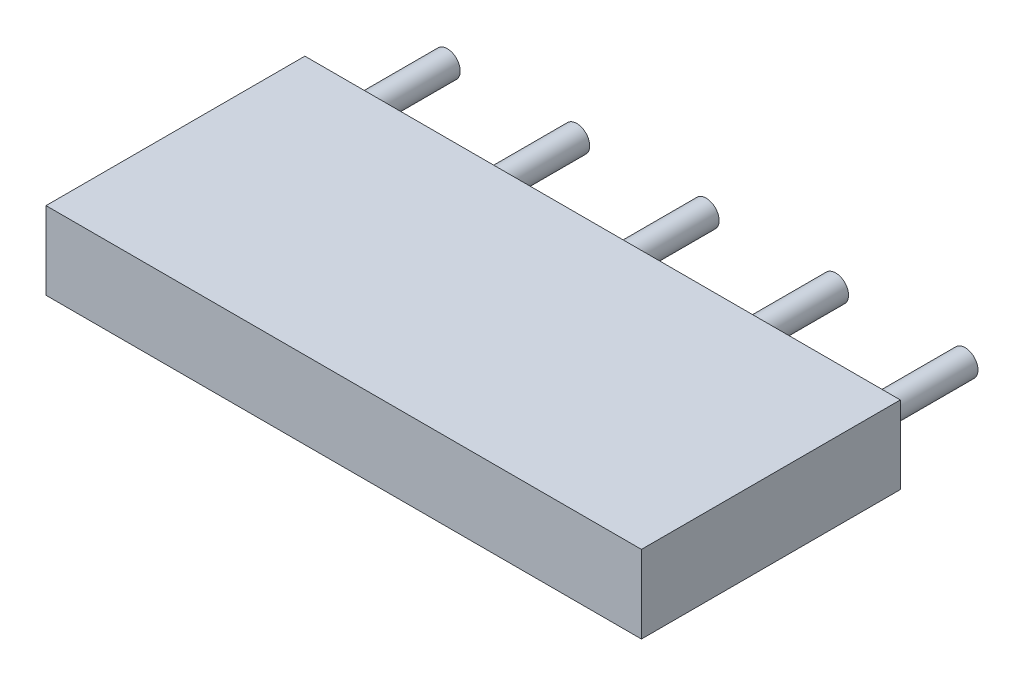
ISO-10303-21;
HEADER;
FILE_DESCRIPTION(('STEP AP214'),'2;1');
FILE_NAME('part.step','',(''),(''),'','','');
FILE_SCHEMA(('AUTOMOTIVE_DESIGN { 1 0 10303 214 1 1 1 1 }'));
ENDSEC;
DATA;
#1=APPLICATION_CONTEXT('core data for automotive mechanical design processes');
#2=APPLICATION_PROTOCOL_DEFINITION('international standard','automotive_design',2000,#1);
#3=PRODUCT_CONTEXT('',#1,'mechanical');
#4=PRODUCT('Part','Part','',(#3));
#5=PRODUCT_RELATED_PRODUCT_CATEGORY('part','',(#4));
#6=PRODUCT_DEFINITION_FORMATION('','',#4);
#7=PRODUCT_DEFINITION_CONTEXT('part definition',#1,'design');
#8=PRODUCT_DEFINITION('design','',#6,#7);
#9=PRODUCT_DEFINITION_SHAPE('','',#8);
#10=(LENGTH_UNIT() NAMED_UNIT(*) SI_UNIT(.MILLI.,.METRE.));
#11=(NAMED_UNIT(*) PLANE_ANGLE_UNIT() SI_UNIT($,.RADIAN.));
#12=(NAMED_UNIT(*) SI_UNIT($,.STERADIAN.) SOLID_ANGLE_UNIT());
#13=UNCERTAINTY_MEASURE_WITH_UNIT(LENGTH_MEASURE(1.E-05),#10,'distance_accuracy_value','');
#14=(GEOMETRIC_REPRESENTATION_CONTEXT(3) GLOBAL_UNCERTAINTY_ASSIGNED_CONTEXT((#13)) GLOBAL_UNIT_ASSIGNED_CONTEXT((#10,
#11,#12)) REPRESENTATION_CONTEXT('',''));
#15=CARTESIAN_POINT('',(0.,0.,0.));
#16=DIRECTION('',(0.,0.,1.));
#17=DIRECTION('',(1.,0.,0.));
#18=AXIS2_PLACEMENT_3D('',#15,#16,#17);
#19=CARTESIAN_POINT('',(10.,0.,-2.));
#20=DIRECTION('',(0.,0.,1.));
#21=DIRECTION('',(1.,0.,0.));
#22=AXIS2_PLACEMENT_3D('',#19,#20,#21);
#23=CYLINDRICAL_SURFACE('',#22,0.25);
#24=CARTESIAN_POINT('',(10.,0.,-2.));
#25=DIRECTION('',(0.,0.,1.));
#26=DIRECTION('',(1.,0.,0.));
#27=AXIS2_PLACEMENT_3D('',#24,#25,#26);
#28=CIRCLE('',#27,0.25);
#29=CARTESIAN_POINT('',(10.25,0.,-2.));
#30=VERTEX_POINT('',#29);
#31=EDGE_CURVE('E11',#30,#30,#28,.T.);
#32=ORIENTED_EDGE('',*,*,#31,.T.);
#33=EDGE_LOOP('',(#32));
#34=FACE_BOUND('',#33,.T.);
#35=CARTESIAN_POINT('',(10.,0.,0.));
#36=DIRECTION('',(0.,0.,1.));
#37=DIRECTION('',(1.,0.,0.));
#38=AXIS2_PLACEMENT_3D('',#35,#36,#37);
#39=CIRCLE('',#38,0.25);
#40=CARTESIAN_POINT('',(10.25,0.,0.));
#41=VERTEX_POINT('',#40);
#42=EDGE_CURVE('E43',#41,#41,#39,.T.);
#43=ORIENTED_EDGE('',*,*,#42,.F.);
#44=EDGE_LOOP('',(#43));
#45=FACE_BOUND('',#44,.T.);
#46=ADVANCED_FACE('F40',(#34,#45),#23,.T.);
#47=CARTESIAN_POINT('',(10.,0.,-2.));
#48=DIRECTION('',(0.,0.,1.));
#49=DIRECTION('',(1.,0.,0.));
#50=AXIS2_PLACEMENT_3D('',#47,#48,#49);
#51=PLANE('',#50);
#52=ORIENTED_EDGE('',*,*,#31,.F.);
#53=EDGE_LOOP('',(#52));
#54=FACE_BOUND('',#53,.T.);
#55=ADVANCED_FACE('F55',(#54),#51,.F.);
#56=CARTESIAN_POINT('',(10.,0.,0.));
#57=DIRECTION('',(0.,0.,1.));
#58=DIRECTION('',(1.,0.,0.));
#59=AXIS2_PLACEMENT_3D('',#56,#57,#58);
#60=PLANE('',#59);
#61=ORIENTED_EDGE('',*,*,#42,.T.);
#62=EDGE_LOOP('',(#61));
#63=FACE_BOUND('',#62,.T.);
#64=ADVANCED_FACE('F52',(#63),#60,.T.);
#65=CLOSED_SHELL('',(#46,#55,#64));
#66=MANIFOLD_SOLID_BREP('B2',#65);
#67=CARTESIAN_POINT('',(7.5,0.,-2.));
#68=DIRECTION('',(0.,0.,1.));
#69=DIRECTION('',(1.,0.,0.));
#70=AXIS2_PLACEMENT_3D('',#67,#68,#69);
#71=CYLINDRICAL_SURFACE('',#70,0.25);
#72=CARTESIAN_POINT('',(7.5,0.,-2.));
#73=DIRECTION('',(0.,0.,1.));
#74=DIRECTION('',(1.,0.,0.));
#75=AXIS2_PLACEMENT_3D('',#72,#73,#74);
#76=CIRCLE('',#75,0.25);
#77=CARTESIAN_POINT('',(7.75,0.,-2.));
#78=VERTEX_POINT('',#77);
#79=EDGE_CURVE('E39',#78,#78,#76,.T.);
#80=ORIENTED_EDGE('',*,*,#79,.T.);
#81=EDGE_LOOP('',(#80));
#82=FACE_BOUND('',#81,.T.);
#83=CARTESIAN_POINT('',(7.5,0.,0.));
#84=DIRECTION('',(0.,0.,1.));
#85=DIRECTION('',(1.,0.,0.));
#86=AXIS2_PLACEMENT_3D('',#83,#84,#85);
#87=CIRCLE('',#86,0.25);
#88=CARTESIAN_POINT('',(7.75,0.,0.));
#89=VERTEX_POINT('',#88);
#90=EDGE_CURVE('E92',#89,#89,#87,.T.);
#91=ORIENTED_EDGE('',*,*,#90,.F.);
#92=EDGE_LOOP('',(#91));
#93=FACE_BOUND('',#92,.T.);
#94=ADVANCED_FACE('F89',(#82,#93),#71,.T.);
#95=CARTESIAN_POINT('',(7.5,0.,-2.));
#96=DIRECTION('',(0.,0.,1.));
#97=DIRECTION('',(1.,0.,0.));
#98=AXIS2_PLACEMENT_3D('',#95,#96,#97);
#99=PLANE('',#98);
#100=ORIENTED_EDGE('',*,*,#79,.F.);
#101=EDGE_LOOP('',(#100));
#102=FACE_BOUND('',#101,.T.);
#103=ADVANCED_FACE('F104',(#102),#99,.F.);
#104=CARTESIAN_POINT('',(7.5,0.,0.));
#105=DIRECTION('',(0.,0.,1.));
#106=DIRECTION('',(1.,0.,0.));
#107=AXIS2_PLACEMENT_3D('',#104,#105,#106);
#108=PLANE('',#107);
#109=ORIENTED_EDGE('',*,*,#90,.T.);
#110=EDGE_LOOP('',(#109));
#111=FACE_BOUND('',#110,.T.);
#112=ADVANCED_FACE('F101',(#111),#108,.T.);
#113=CLOSED_SHELL('',(#94,#103,#112));
#114=MANIFOLD_SOLID_BREP('B6',#113);
#115=CARTESIAN_POINT('',(5.,0.,-2.));
#116=DIRECTION('',(0.,0.,1.));
#117=DIRECTION('',(1.,0.,0.));
#118=AXIS2_PLACEMENT_3D('',#115,#116,#117);
#119=CYLINDRICAL_SURFACE('',#118,0.25);
#120=CARTESIAN_POINT('',(5.,0.,-2.));
#121=DIRECTION('',(0.,0.,1.));
#122=DIRECTION('',(1.,0.,0.));
#123=AXIS2_PLACEMENT_3D('',#120,#121,#122);
#124=CIRCLE('',#123,0.25);
#125=CARTESIAN_POINT('',(5.25,0.,-2.));
#126=VERTEX_POINT('',#125);
#127=EDGE_CURVE('E88',#126,#126,#124,.T.);
#128=ORIENTED_EDGE('',*,*,#127,.T.);
#129=EDGE_LOOP('',(#128));
#130=FACE_BOUND('',#129,.T.);
#131=CARTESIAN_POINT('',(5.,0.,0.));
#132=DIRECTION('',(0.,0.,1.));
#133=DIRECTION('',(1.,0.,0.));
#134=AXIS2_PLACEMENT_3D('',#131,#132,#133);
#135=CIRCLE('',#134,0.25);
#136=CARTESIAN_POINT('',(5.25,0.,0.));
#137=VERTEX_POINT('',#136);
#138=EDGE_CURVE('E141',#137,#137,#135,.T.);
#139=ORIENTED_EDGE('',*,*,#138,.F.);
#140=EDGE_LOOP('',(#139));
#141=FACE_BOUND('',#140,.T.);
#142=ADVANCED_FACE('F138',(#130,#141),#119,.T.);
#143=CARTESIAN_POINT('',(5.,0.,-2.));
#144=DIRECTION('',(0.,0.,1.));
#145=DIRECTION('',(1.,0.,0.));
#146=AXIS2_PLACEMENT_3D('',#143,#144,#145);
#147=PLANE('',#146);
#148=ORIENTED_EDGE('',*,*,#127,.F.);
#149=EDGE_LOOP('',(#148));
#150=FACE_BOUND('',#149,.T.);
#151=ADVANCED_FACE('F153',(#150),#147,.F.);
#152=CARTESIAN_POINT('',(5.,0.,0.));
#153=DIRECTION('',(0.,0.,1.));
#154=DIRECTION('',(1.,0.,0.));
#155=AXIS2_PLACEMENT_3D('',#152,#153,#154);
#156=PLANE('',#155);
#157=ORIENTED_EDGE('',*,*,#138,.T.);
#158=EDGE_LOOP('',(#157));
#159=FACE_BOUND('',#158,.T.);
#160=ADVANCED_FACE('F150',(#159),#156,.T.);
#161=CLOSED_SHELL('',(#142,#151,#160));
#162=MANIFOLD_SOLID_BREP('B34',#161);
#163=CARTESIAN_POINT('',(2.5,0.,-2.));
#164=DIRECTION('',(0.,0.,1.));
#165=DIRECTION('',(1.,0.,0.));
#166=AXIS2_PLACEMENT_3D('',#163,#164,#165);
#167=CYLINDRICAL_SURFACE('',#166,0.25);
#168=CARTESIAN_POINT('',(2.5,0.,-2.));
#169=DIRECTION('',(0.,0.,1.));
#170=DIRECTION('',(1.,0.,0.));
#171=AXIS2_PLACEMENT_3D('',#168,#169,#170);
#172=CIRCLE('',#171,0.25);
#173=CARTESIAN_POINT('',(2.75,0.,-2.));
#174=VERTEX_POINT('',#173);
#175=EDGE_CURVE('E137',#174,#174,#172,.T.);
#176=ORIENTED_EDGE('',*,*,#175,.T.);
#177=EDGE_LOOP('',(#176));
#178=FACE_BOUND('',#177,.T.);
#179=CARTESIAN_POINT('',(2.5,0.,0.));
#180=DIRECTION('',(0.,0.,1.));
#181=DIRECTION('',(1.,0.,0.));
#182=AXIS2_PLACEMENT_3D('',#179,#180,#181);
#183=CIRCLE('',#182,0.25);
#184=CARTESIAN_POINT('',(2.75,0.,0.));
#185=VERTEX_POINT('',#184);
#186=EDGE_CURVE('E190',#185,#185,#183,.T.);
#187=ORIENTED_EDGE('',*,*,#186,.F.);
#188=EDGE_LOOP('',(#187));
#189=FACE_BOUND('',#188,.T.);
#190=ADVANCED_FACE('F187',(#178,#189),#167,.T.);
#191=CARTESIAN_POINT('',(2.5,0.,-2.));
#192=DIRECTION('',(0.,0.,1.));
#193=DIRECTION('',(1.,0.,0.));
#194=AXIS2_PLACEMENT_3D('',#191,#192,#193);
#195=PLANE('',#194);
#196=ORIENTED_EDGE('',*,*,#175,.F.);
#197=EDGE_LOOP('',(#196));
#198=FACE_BOUND('',#197,.T.);
#199=ADVANCED_FACE('F202',(#198),#195,.F.);
#200=CARTESIAN_POINT('',(2.5,0.,0.));
#201=DIRECTION('',(0.,0.,1.));
#202=DIRECTION('',(1.,0.,0.));
#203=AXIS2_PLACEMENT_3D('',#200,#201,#202);
#204=PLANE('',#203);
#205=ORIENTED_EDGE('',*,*,#186,.T.);
#206=EDGE_LOOP('',(#205));
#207=FACE_BOUND('',#206,.T.);
#208=ADVANCED_FACE('F199',(#207),#204,.T.);
#209=CLOSED_SHELL('',(#190,#199,#208));
#210=MANIFOLD_SOLID_BREP('B83',#209);
#211=CARTESIAN_POINT('',(0.,0.,-2.));
#212=DIRECTION('',(0.,0.,1.));
#213=DIRECTION('',(1.,0.,0.));
#214=AXIS2_PLACEMENT_3D('',#211,#212,#213);
#215=CYLINDRICAL_SURFACE('',#214,0.25);
#216=CARTESIAN_POINT('',(0.,0.,-2.));
#217=DIRECTION('',(0.,0.,1.));
#218=DIRECTION('',(1.,0.,0.));
#219=AXIS2_PLACEMENT_3D('',#216,#217,#218);
#220=CIRCLE('',#219,0.25);
#221=CARTESIAN_POINT('',(0.25,0.,-2.));
#222=VERTEX_POINT('',#221);
#223=EDGE_CURVE('E186',#222,#222,#220,.T.);
#224=ORIENTED_EDGE('',*,*,#223,.T.);
#225=EDGE_LOOP('',(#224));
#226=FACE_BOUND('',#225,.T.);
#227=CARTESIAN_POINT('',(0.,0.,0.));
#228=DIRECTION('',(0.,0.,1.));
#229=DIRECTION('',(1.,0.,0.));
#230=AXIS2_PLACEMENT_3D('',#227,#228,#229);
#231=CIRCLE('',#230,0.25);
#232=CARTESIAN_POINT('',(0.25,0.,0.));
#233=VERTEX_POINT('',#232);
#234=EDGE_CURVE('E240',#233,#233,#231,.T.);
#235=ORIENTED_EDGE('',*,*,#234,.F.);
#236=EDGE_LOOP('',(#235));
#237=FACE_BOUND('',#236,.T.);
#238=ADVANCED_FACE('F237',(#226,#237),#215,.T.);
#239=CARTESIAN_POINT('',(0.,0.,-2.));
#240=DIRECTION('',(0.,0.,1.));
#241=DIRECTION('',(1.,0.,0.));
#242=AXIS2_PLACEMENT_3D('',#239,#240,#241);
#243=PLANE('',#242);
#244=ORIENTED_EDGE('',*,*,#223,.F.);
#245=EDGE_LOOP('',(#244));
#246=FACE_BOUND('',#245,.T.);
#247=ADVANCED_FACE('F252',(#246),#243,.F.);
#248=CARTESIAN_POINT('',(0.,0.,0.));
#249=DIRECTION('',(0.,0.,1.));
#250=DIRECTION('',(1.,0.,0.));
#251=AXIS2_PLACEMENT_3D('',#248,#249,#250);
#252=PLANE('',#251);
#253=ORIENTED_EDGE('',*,*,#234,.T.);
#254=EDGE_LOOP('',(#253));
#255=FACE_BOUND('',#254,.T.);
#256=ADVANCED_FACE('F249',(#255),#252,.T.);
#257=CLOSED_SHELL('',(#238,#247,#256));
#258=MANIFOLD_SOLID_BREP('B132',#257);
#259=CARTESIAN_POINT('',(10.75,0.75,5.));
#260=DIRECTION('',(0.,-1.,0.));
#261=DIRECTION('',(0.,0.,-1.));
#262=AXIS2_PLACEMENT_3D('',#259,#260,#261);
#263=PLANE('',#262);
#264=DIRECTION('',(-1.,0.,0.));
#265=VECTOR('',#264,1.);
#266=CARTESIAN_POINT('',(10.75,0.75,0.));
#267=LINE('',#266,#265);
#268=CARTESIAN_POINT('',(10.75,0.75,0.));
#269=VERTEX_POINT('',#268);
#270=CARTESIAN_POINT('',(-0.75,0.75,0.));
#271=VERTEX_POINT('',#270);
#272=EDGE_CURVE('E341',#269,#271,#267,.T.);
#273=ORIENTED_EDGE('',*,*,#272,.T.);
#274=DIRECTION('',(0.,0.,-1.));
#275=VECTOR('',#274,1.);
#276=CARTESIAN_POINT('',(-0.75,0.75,5.));
#277=LINE('',#276,#275);
#278=CARTESIAN_POINT('',(-0.75,0.75,5.));
#279=VERTEX_POINT('',#278);
#280=EDGE_CURVE('E235',#279,#271,#277,.T.);
#281=ORIENTED_EDGE('',*,*,#280,.F.);
#282=DIRECTION('',(-1.,0.,0.));
#283=VECTOR('',#282,1.);
#284=CARTESIAN_POINT('',(10.75,0.75,5.));
#285=LINE('',#284,#283);
#286=CARTESIAN_POINT('',(10.75,0.75,5.));
#287=VERTEX_POINT('',#286);
#288=EDGE_CURVE('E329',#287,#279,#285,.T.);
#289=ORIENTED_EDGE('',*,*,#288,.F.);
#290=DIRECTION('',(0.,0.,-1.));
#291=VECTOR('',#290,1.);
#292=CARTESIAN_POINT('',(10.75,0.75,5.));
#293=LINE('',#292,#291);
#294=EDGE_CURVE('E337',#287,#269,#293,.T.);
#295=ORIENTED_EDGE('',*,*,#294,.T.);
#296=EDGE_LOOP('',(#273,#281,#289,#295));
#297=FACE_BOUND('',#296,.T.);
#298=ADVANCED_FACE('F278',(#297),#263,.F.);
#299=CARTESIAN_POINT('',(-0.75,0.75,5.));
#300=DIRECTION('',(1.,0.,0.));
#301=DIRECTION('',(0.,0.,-1.));
#302=AXIS2_PLACEMENT_3D('',#299,#300,#301);
#303=PLANE('',#302);
#304=DIRECTION('',(0.,-1.,0.));
#305=VECTOR('',#304,1.);
#306=CARTESIAN_POINT('',(-0.75,0.75,0.));
#307=LINE('',#306,#305);
#308=CARTESIAN_POINT('',(-0.75,-0.75,0.));
#309=VERTEX_POINT('',#308);
#310=EDGE_CURVE('E333',#271,#309,#307,.T.);
#311=ORIENTED_EDGE('',*,*,#310,.T.);
#312=DIRECTION('',(0.,0.,-1.));
#313=VECTOR('',#312,1.);
#314=CARTESIAN_POINT('',(-0.75,-0.75,5.));
#315=LINE('',#314,#313);
#316=CARTESIAN_POINT('',(-0.75,-0.75,5.));
#317=VERTEX_POINT('',#316);
#318=EDGE_CURVE('E286',#317,#309,#315,.T.);
#319=ORIENTED_EDGE('',*,*,#318,.F.);
#320=DIRECTION('',(0.,-1.,0.));
#321=VECTOR('',#320,1.);
#322=CARTESIAN_POINT('',(-0.75,0.75,5.));
#323=LINE('',#322,#321);
#324=EDGE_CURVE('E324',#279,#317,#323,.T.);
#325=ORIENTED_EDGE('',*,*,#324,.F.);
#326=ORIENTED_EDGE('',*,*,#280,.T.);
#327=EDGE_LOOP('',(#311,#319,#325,#326));
#328=FACE_BOUND('',#327,.T.);
#329=ADVANCED_FACE('F332',(#328),#303,.F.);
#330=CARTESIAN_POINT('',(-0.75,-0.75,5.));
#331=DIRECTION('',(0.,1.,0.));
#332=DIRECTION('',(0.,0.,1.));
#333=AXIS2_PLACEMENT_3D('',#330,#331,#332);
#334=PLANE('',#333);
#335=DIRECTION('',(1.,0.,0.));
#336=VECTOR('',#335,1.);
#337=CARTESIAN_POINT('',(-0.75,-0.75,0.));
#338=LINE('',#337,#336);
#339=CARTESIAN_POINT('',(10.75,-0.75,0.));
#340=VERTEX_POINT('',#339);
#341=EDGE_CURVE('E311',#309,#340,#338,.T.);
#342=ORIENTED_EDGE('',*,*,#341,.T.);
#343=DIRECTION('',(0.,0.,-1.));
#344=VECTOR('',#343,1.);
#345=CARTESIAN_POINT('',(10.75,-0.75,5.));
#346=LINE('',#345,#344);
#347=CARTESIAN_POINT('',(10.75,-0.75,5.));
#348=VERTEX_POINT('',#347);
#349=EDGE_CURVE('E334',#348,#340,#346,.T.);
#350=ORIENTED_EDGE('',*,*,#349,.F.);
#351=DIRECTION('',(1.,0.,0.));
#352=VECTOR('',#351,1.);
#353=CARTESIAN_POINT('',(-0.75,-0.75,5.));
#354=LINE('',#353,#352);
#355=EDGE_CURVE('E327',#317,#348,#354,.T.);
#356=ORIENTED_EDGE('',*,*,#355,.F.);
#357=ORIENTED_EDGE('',*,*,#318,.T.);
#358=EDGE_LOOP('',(#342,#350,#356,#357));
#359=FACE_BOUND('',#358,.T.);
#360=ADVANCED_FACE('F335',(#359),#334,.F.);
#361=CARTESIAN_POINT('',(10.75,-0.75,5.));
#362=DIRECTION('',(-1.,0.,0.));
#363=DIRECTION('',(0.,0.,1.));
#364=AXIS2_PLACEMENT_3D('',#361,#362,#363);
#365=PLANE('',#364);
#366=DIRECTION('',(0.,1.,0.));
#367=VECTOR('',#366,1.);
#368=CARTESIAN_POINT('',(10.75,-0.75,0.));
#369=LINE('',#368,#367);
#370=EDGE_CURVE('E317',#340,#269,#369,.T.);
#371=ORIENTED_EDGE('',*,*,#370,.T.);
#372=ORIENTED_EDGE('',*,*,#294,.F.);
#373=DIRECTION('',(0.,1.,0.));
#374=VECTOR('',#373,1.);
#375=CARTESIAN_POINT('',(10.75,-0.75,5.));
#376=LINE('',#375,#374);
#377=EDGE_CURVE('E294',#348,#287,#376,.T.);
#378=ORIENTED_EDGE('',*,*,#377,.F.);
#379=ORIENTED_EDGE('',*,*,#349,.T.);
#380=EDGE_LOOP('',(#371,#372,#378,#379));
#381=FACE_BOUND('',#380,.T.);
#382=ADVANCED_FACE('F348',(#381),#365,.F.);
#383=CARTESIAN_POINT('',(0.,0.,5.));
#384=DIRECTION('',(0.,0.,1.));
#385=DIRECTION('',(1.,0.,0.));
#386=AXIS2_PLACEMENT_3D('',#383,#384,#385);
#387=PLANE('',#386);
#388=ORIENTED_EDGE('',*,*,#288,.T.);
#389=ORIENTED_EDGE('',*,*,#324,.T.);
#390=ORIENTED_EDGE('',*,*,#355,.T.);
#391=ORIENTED_EDGE('',*,*,#377,.T.);
#392=EDGE_LOOP('',(#388,#389,#390,#391));
#393=FACE_BOUND('',#392,.T.);
#394=ADVANCED_FACE('F325',(#393),#387,.T.);
#395=CARTESIAN_POINT('',(0.,0.,0.));
#396=DIRECTION('',(0.,0.,1.));
#397=DIRECTION('',(1.,0.,0.));
#398=AXIS2_PLACEMENT_3D('',#395,#396,#397);
#399=PLANE('',#398);
#400=ORIENTED_EDGE('',*,*,#272,.F.);
#401=ORIENTED_EDGE('',*,*,#370,.F.);
#402=ORIENTED_EDGE('',*,*,#341,.F.);
#403=ORIENTED_EDGE('',*,*,#310,.F.);
#404=EDGE_LOOP('',(#400,#401,#402,#403));
#405=FACE_BOUND('',#404,.T.);
#406=ADVANCED_FACE('F351',(#405),#399,.F.);
#407=CLOSED_SHELL('',(#298,#329,#360,#382,#394,#406));
#408=MANIFOLD_SOLID_BREP('B181',#407);
#409=ADVANCED_BREP_SHAPE_REPRESENTATION('',(#18,#66,#114,#162,#210,#258,#408),#14);
#410=SHAPE_DEFINITION_REPRESENTATION(#9,#409);
ENDSEC;
END-ISO-10303-21;
